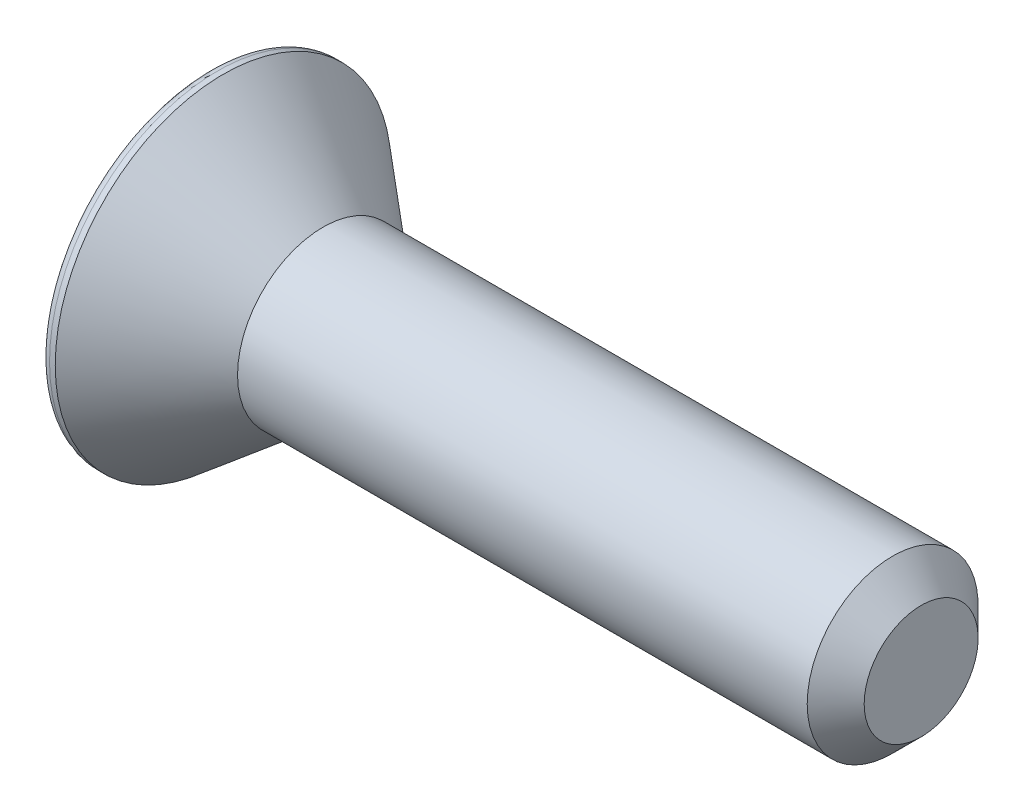
ISO-10303-21;
HEADER;
FILE_DESCRIPTION(('STEP AP214'),'2;1');
FILE_NAME('part.step','',(''),(''),'','','');
FILE_SCHEMA(('AUTOMOTIVE_DESIGN { 1 0 10303 214 1 1 1 1 }'));
ENDSEC;
DATA;
#1=APPLICATION_CONTEXT('core data for automotive mechanical design processes');
#2=APPLICATION_PROTOCOL_DEFINITION('international standard','automotive_design',2000,#1);
#3=PRODUCT_CONTEXT('',#1,'mechanical');
#4=PRODUCT('Part','Part','',(#3));
#5=PRODUCT_RELATED_PRODUCT_CATEGORY('part','',(#4));
#6=PRODUCT_DEFINITION_FORMATION('','',#4);
#7=PRODUCT_DEFINITION_CONTEXT('part definition',#1,'design');
#8=PRODUCT_DEFINITION('design','',#6,#7);
#9=PRODUCT_DEFINITION_SHAPE('','',#8);
#10=(LENGTH_UNIT() NAMED_UNIT(*) SI_UNIT(.MILLI.,.METRE.));
#11=(NAMED_UNIT(*) PLANE_ANGLE_UNIT() SI_UNIT($,.RADIAN.));
#12=(NAMED_UNIT(*) SI_UNIT($,.STERADIAN.) SOLID_ANGLE_UNIT());
#13=UNCERTAINTY_MEASURE_WITH_UNIT(LENGTH_MEASURE(1.E-05),#10,'distance_accuracy_value','');
#14=(GEOMETRIC_REPRESENTATION_CONTEXT(3) GLOBAL_UNCERTAINTY_ASSIGNED_CONTEXT((#13)) GLOBAL_UNIT_ASSIGNED_CONTEXT((#10,
#11,#12)) REPRESENTATION_CONTEXT('',''));
#15=CARTESIAN_POINT('',(0.,0.,0.));
#16=DIRECTION('',(0.,0.,1.));
#17=DIRECTION('',(1.,0.,0.));
#18=AXIS2_PLACEMENT_3D('',#15,#16,#17);
#19=CARTESIAN_POINT('',(0.,0.,0.));
#20=DIRECTION('',(1.,0.,0.));
#21=DIRECTION('',(0.,0.,-1.));
#22=AXIS2_PLACEMENT_3D('',#19,#20,#21);
#23=PLANE('',#22);
#24=CARTESIAN_POINT('',(0.,0.,0.));
#25=DIRECTION('',(1.,0.,0.));
#26=DIRECTION('',(0.,0.,-1.));
#27=AXIS2_PLACEMENT_3D('',#24,#25,#26);
#28=CIRCLE('',#27,5.6);
#29=CARTESIAN_POINT('',(0.,0.,-5.6));
#30=VERTEX_POINT('',#29);
#31=EDGE_CURVE('E153',#30,#30,#28,.F.);
#32=ORIENTED_EDGE('',*,*,#31,.T.);
#33=EDGE_LOOP('',(#32));
#34=FACE_BOUND('',#33,.T.);
#35=DIRECTION('',(0.,0.,-1.));
#36=VECTOR('',#35,1.);
#37=CARTESIAN_POINT('',(0.,2.,1.15470053837925));
#38=LINE('',#37,#36);
#39=CARTESIAN_POINT('',(0.,2.,1.15470053837925));
#40=VERTEX_POINT('',#39);
#41=CARTESIAN_POINT('',(0.,2.,-1.15470053837925));
#42=VERTEX_POINT('',#41);
#43=EDGE_CURVE('E129',#40,#42,#38,.T.);
#44=ORIENTED_EDGE('',*,*,#43,.F.);
#45=DIRECTION('',(0.,0.866025403784438,-0.5));
#46=VECTOR('',#45,1.);
#47=CARTESIAN_POINT('',(0.,0.,2.3094010767585));
#48=LINE('',#47,#46);
#49=CARTESIAN_POINT('',(0.,0.,2.3094010767585));
#50=VERTEX_POINT('',#49);
#51=EDGE_CURVE('E55',#50,#40,#48,.T.);
#52=ORIENTED_EDGE('',*,*,#51,.F.);
#53=DIRECTION('',(0.,0.866025403784438,0.5));
#54=VECTOR('',#53,1.);
#55=CARTESIAN_POINT('',(0.,-2.,1.15470053837925));
#56=LINE('',#55,#54);
#57=CARTESIAN_POINT('',(0.,-2.,1.15470053837925));
#58=VERTEX_POINT('',#57);
#59=EDGE_CURVE('E138',#58,#50,#56,.T.);
#60=ORIENTED_EDGE('',*,*,#59,.F.);
#61=DIRECTION('',(0.,0.,1.));
#62=VECTOR('',#61,1.);
#63=CARTESIAN_POINT('',(0.,-2.,-1.15470053837925));
#64=LINE('',#63,#62);
#65=CARTESIAN_POINT('',(0.,-2.,-1.15470053837925));
#66=VERTEX_POINT('',#65);
#67=EDGE_CURVE('E136',#66,#58,#64,.T.);
#68=ORIENTED_EDGE('',*,*,#67,.F.);
#69=DIRECTION('',(0.,-0.866025403784439,0.5));
#70=VECTOR('',#69,1.);
#71=CARTESIAN_POINT('',(0.,0.,-2.3094010767585));
#72=LINE('',#71,#70);
#73=CARTESIAN_POINT('',(0.,0.,-2.3094010767585));
#74=VERTEX_POINT('',#73);
#75=EDGE_CURVE('E103',#74,#66,#72,.T.);
#76=ORIENTED_EDGE('',*,*,#75,.F.);
#77=DIRECTION('',(0.,-0.866025403784439,-0.5));
#78=VECTOR('',#77,1.);
#79=CARTESIAN_POINT('',(0.,2.,-1.15470053837925));
#80=LINE('',#79,#78);
#81=EDGE_CURVE('E132',#42,#74,#80,.T.);
#82=ORIENTED_EDGE('',*,*,#81,.F.);
#83=EDGE_LOOP('',(#44,#52,#60,#68,#76,#82));
#84=FACE_BOUND('',#83,.T.);
#85=ADVANCED_FACE('F39',(#34,#84),#23,.F.);
#86=CARTESIAN_POINT('',(0.,0.,0.));
#87=DIRECTION('',(-1.,0.,0.));
#88=DIRECTION('',(0.,0.,1.));
#89=AXIS2_PLACEMENT_3D('',#86,#87,#88);
#90=CYLINDRICAL_SURFACE('',#89,5.9);
#91=CARTESIAN_POINT('',(0.3,0.,0.));
#92=DIRECTION('',(1.,0.,0.));
#93=DIRECTION('',(0.,0.,-1.));
#94=AXIS2_PLACEMENT_3D('',#91,#92,#93);
#95=CIRCLE('',#94,5.9);
#96=CARTESIAN_POINT('',(0.3,0.,-5.9));
#97=VERTEX_POINT('',#96);
#98=EDGE_CURVE('E156',#97,#97,#95,.T.);
#99=ORIENTED_EDGE('',*,*,#98,.T.);
#100=EDGE_LOOP('',(#99));
#101=FACE_BOUND('',#100,.T.);
#102=CARTESIAN_POINT('',(0.5,0.,0.));
#103=DIRECTION('',(-1.,0.,0.));
#104=DIRECTION('',(0.,0.,1.));
#105=AXIS2_PLACEMENT_3D('',#102,#103,#104);
#106=CIRCLE('',#105,5.9);
#107=CARTESIAN_POINT('',(0.5,0.,5.9));
#108=VERTEX_POINT('',#107);
#109=EDGE_CURVE('E150',#108,#108,#106,.T.);
#110=ORIENTED_EDGE('',*,*,#109,.T.);
#111=EDGE_LOOP('',(#110));
#112=FACE_BOUND('',#111,.T.);
#113=ADVANCED_FACE('F173',(#101,#112),#90,.T.);
#114=CARTESIAN_POINT('',(4.,0.,0.));
#115=DIRECTION('',(-1.,0.,0.));
#116=DIRECTION('',(0.,0.,1.));
#117=AXIS2_PLACEMENT_3D('',#114,#115,#116);
#118=CONICAL_SURFACE('',#117,3.,0.691921382238859);
#119=ORIENTED_EDGE('',*,*,#109,.F.);
#120=EDGE_LOOP('',(#119));
#121=FACE_BOUND('',#120,.T.);
#122=CARTESIAN_POINT('',(4.,0.,0.));
#123=DIRECTION('',(-1.,0.,0.));
#124=DIRECTION('',(0.,0.,1.));
#125=AXIS2_PLACEMENT_3D('',#122,#123,#124);
#126=CIRCLE('',#125,3.);
#127=CARTESIAN_POINT('',(4.,0.,3.));
#128=VERTEX_POINT('',#127);
#129=EDGE_CURVE('E142',#128,#128,#126,.T.);
#130=ORIENTED_EDGE('',*,*,#129,.T.);
#131=EDGE_LOOP('',(#130));
#132=FACE_BOUND('',#131,.T.);
#133=ADVANCED_FACE('F179',(#121,#132),#118,.T.);
#134=CARTESIAN_POINT('',(0.,0.,0.));
#135=DIRECTION('',(-1.,0.,0.));
#136=DIRECTION('',(0.,0.,1.));
#137=AXIS2_PLACEMENT_3D('',#134,#135,#136);
#138=CYLINDRICAL_SURFACE('',#137,3.);
#139=CARTESIAN_POINT('',(24.,0.,0.));
#140=DIRECTION('',(-1.,0.,0.));
#141=DIRECTION('',(0.,0.,1.));
#142=AXIS2_PLACEMENT_3D('',#139,#140,#141);
#143=CIRCLE('',#142,3.);
#144=CARTESIAN_POINT('',(24.,0.,3.));
#145=VERTEX_POINT('',#144);
#146=EDGE_CURVE('E48',#145,#145,#143,.T.);
#147=ORIENTED_EDGE('',*,*,#146,.T.);
#148=EDGE_LOOP('',(#147));
#149=FACE_BOUND('',#148,.T.);
#150=ORIENTED_EDGE('',*,*,#129,.F.);
#151=EDGE_LOOP('',(#150));
#152=FACE_BOUND('',#151,.T.);
#153=ADVANCED_FACE('F161',(#149,#152),#138,.T.);
#154=CARTESIAN_POINT('',(25.,3.,0.));
#155=DIRECTION('',(-1.,0.,0.));
#156=DIRECTION('',(0.,0.,1.));
#157=AXIS2_PLACEMENT_3D('',#154,#155,#156);
#158=PLANE('',#157);
#159=CARTESIAN_POINT('',(25.,0.,0.));
#160=DIRECTION('',(-1.,0.,0.));
#161=DIRECTION('',(0.,0.,1.));
#162=AXIS2_PLACEMENT_3D('',#159,#160,#161);
#163=CIRCLE('',#162,1.99999999999998);
#164=CARTESIAN_POINT('',(25.,0.,1.99999999999998));
#165=VERTEX_POINT('',#164);
#166=EDGE_CURVE('E11',#165,#165,#163,.F.);
#167=ORIENTED_EDGE('',*,*,#166,.T.);
#168=EDGE_LOOP('',(#167));
#169=FACE_BOUND('',#168,.T.);
#170=ADVANCED_FACE('F189',(#169),#158,.F.);
#171=CARTESIAN_POINT('',(3.,0.,2.3094010767585));
#172=DIRECTION('',(0.,0.5,0.866025403784439));
#173=DIRECTION('',(0.,-0.866025403784439,0.5));
#174=AXIS2_PLACEMENT_3D('',#171,#172,#173);
#175=PLANE('',#174);
#176=ORIENTED_EDGE('',*,*,#51,.T.);
#177=DIRECTION('',(-1.,0.,0.));
#178=VECTOR('',#177,1.);
#179=CARTESIAN_POINT('',(3.,2.,1.15470053837925));
#180=LINE('',#179,#178);
#181=CARTESIAN_POINT('',(3.,2.,1.15470053837925));
#182=VERTEX_POINT('',#181);
#183=EDGE_CURVE('E85',#182,#40,#180,.T.);
#184=ORIENTED_EDGE('',*,*,#183,.F.);
#185=DIRECTION('',(0.,0.866025403784438,-0.5));
#186=VECTOR('',#185,1.);
#187=CARTESIAN_POINT('',(3.,0.,2.3094010767585));
#188=LINE('',#187,#186);
#189=CARTESIAN_POINT('',(3.,0.,2.3094010767585));
#190=VERTEX_POINT('',#189);
#191=EDGE_CURVE('E140',#190,#182,#188,.T.);
#192=ORIENTED_EDGE('',*,*,#191,.F.);
#193=DIRECTION('',(-1.,0.,0.));
#194=VECTOR('',#193,1.);
#195=CARTESIAN_POINT('',(3.,0.,2.3094010767585));
#196=LINE('',#195,#194);
#197=EDGE_CURVE('E63',#190,#50,#196,.T.);
#198=ORIENTED_EDGE('',*,*,#197,.T.);
#199=EDGE_LOOP('',(#176,#184,#192,#198));
#200=FACE_BOUND('',#199,.T.);
#201=ADVANCED_FACE('F192',(#200),#175,.F.);
#202=CARTESIAN_POINT('',(3.,-2.,1.15470053837925));
#203=DIRECTION('',(0.,-0.5,0.866025403784439));
#204=DIRECTION('',(0.,-0.866025403784439,-0.5));
#205=AXIS2_PLACEMENT_3D('',#202,#203,#204);
#206=PLANE('',#205);
#207=ORIENTED_EDGE('',*,*,#59,.T.);
#208=ORIENTED_EDGE('',*,*,#197,.F.);
#209=DIRECTION('',(0.,0.866025403784438,0.5));
#210=VECTOR('',#209,1.);
#211=CARTESIAN_POINT('',(3.,-2.,1.15470053837925));
#212=LINE('',#211,#210);
#213=CARTESIAN_POINT('',(3.,-2.,1.15470053837925));
#214=VERTEX_POINT('',#213);
#215=EDGE_CURVE('E115',#214,#190,#212,.T.);
#216=ORIENTED_EDGE('',*,*,#215,.F.);
#217=DIRECTION('',(-1.,0.,0.));
#218=VECTOR('',#217,1.);
#219=CARTESIAN_POINT('',(3.,-2.,1.15470053837925));
#220=LINE('',#219,#218);
#221=EDGE_CURVE('E107',#214,#58,#220,.T.);
#222=ORIENTED_EDGE('',*,*,#221,.T.);
#223=EDGE_LOOP('',(#207,#208,#216,#222));
#224=FACE_BOUND('',#223,.T.);
#225=ADVANCED_FACE('F196',(#224),#206,.F.);
#226=CARTESIAN_POINT('',(3.,-2.,-1.15470053837925));
#227=DIRECTION('',(0.,-1.,0.));
#228=DIRECTION('',(0.,0.,-1.));
#229=AXIS2_PLACEMENT_3D('',#226,#227,#228);
#230=PLANE('',#229);
#231=ORIENTED_EDGE('',*,*,#67,.T.);
#232=ORIENTED_EDGE('',*,*,#221,.F.);
#233=DIRECTION('',(0.,0.,1.));
#234=VECTOR('',#233,1.);
#235=CARTESIAN_POINT('',(3.,-2.,-1.15470053837925));
#236=LINE('',#235,#234);
#237=CARTESIAN_POINT('',(3.,-2.,-1.15470053837925));
#238=VERTEX_POINT('',#237);
#239=EDGE_CURVE('E111',#238,#214,#236,.T.);
#240=ORIENTED_EDGE('',*,*,#239,.F.);
#241=DIRECTION('',(-1.,0.,0.));
#242=VECTOR('',#241,1.);
#243=CARTESIAN_POINT('',(3.,-2.,-1.15470053837925));
#244=LINE('',#243,#242);
#245=EDGE_CURVE('E96',#238,#66,#244,.T.);
#246=ORIENTED_EDGE('',*,*,#245,.T.);
#247=EDGE_LOOP('',(#231,#232,#240,#246));
#248=FACE_BOUND('',#247,.T.);
#249=ADVANCED_FACE('F112',(#248),#230,.F.);
#250=CARTESIAN_POINT('',(3.,0.,-2.3094010767585));
#251=DIRECTION('',(0.,-0.5,-0.866025403784439));
#252=DIRECTION('',(0.,0.866025403784439,-0.5));
#253=AXIS2_PLACEMENT_3D('',#250,#251,#252);
#254=PLANE('',#253);
#255=ORIENTED_EDGE('',*,*,#75,.T.);
#256=ORIENTED_EDGE('',*,*,#245,.F.);
#257=DIRECTION('',(0.,-0.866025403784439,0.5));
#258=VECTOR('',#257,1.);
#259=CARTESIAN_POINT('',(3.,0.,-2.3094010767585));
#260=LINE('',#259,#258);
#261=CARTESIAN_POINT('',(3.,0.,-2.3094010767585));
#262=VERTEX_POINT('',#261);
#263=EDGE_CURVE('E100',#262,#238,#260,.T.);
#264=ORIENTED_EDGE('',*,*,#263,.F.);
#265=DIRECTION('',(-1.,0.,0.));
#266=VECTOR('',#265,1.);
#267=CARTESIAN_POINT('',(3.,0.,-2.3094010767585));
#268=LINE('',#267,#266);
#269=EDGE_CURVE('E108',#262,#74,#268,.T.);
#270=ORIENTED_EDGE('',*,*,#269,.T.);
#271=EDGE_LOOP('',(#255,#256,#264,#270));
#272=FACE_BOUND('',#271,.T.);
#273=ADVANCED_FACE('F98',(#272),#254,.F.);
#274=CARTESIAN_POINT('',(3.,2.,-1.15470053837925));
#275=DIRECTION('',(0.,0.5,-0.866025403784439));
#276=DIRECTION('',(0.,0.866025403784439,0.5));
#277=AXIS2_PLACEMENT_3D('',#274,#275,#276);
#278=PLANE('',#277);
#279=ORIENTED_EDGE('',*,*,#81,.T.);
#280=ORIENTED_EDGE('',*,*,#269,.F.);
#281=DIRECTION('',(0.,-0.866025403784439,-0.5));
#282=VECTOR('',#281,1.);
#283=CARTESIAN_POINT('',(3.,2.,-1.15470053837925));
#284=LINE('',#283,#282);
#285=CARTESIAN_POINT('',(3.,2.,-1.15470053837925));
#286=VERTEX_POINT('',#285);
#287=EDGE_CURVE('E121',#286,#262,#284,.T.);
#288=ORIENTED_EDGE('',*,*,#287,.F.);
#289=DIRECTION('',(-1.,0.,0.));
#290=VECTOR('',#289,1.);
#291=CARTESIAN_POINT('',(3.,2.,-1.15470053837925));
#292=LINE('',#291,#290);
#293=EDGE_CURVE('E145',#286,#42,#292,.T.);
#294=ORIENTED_EDGE('',*,*,#293,.T.);
#295=EDGE_LOOP('',(#279,#280,#288,#294));
#296=FACE_BOUND('',#295,.T.);
#297=ADVANCED_FACE('F200',(#296),#278,.F.);
#298=CARTESIAN_POINT('',(3.,2.,1.15470053837925));
#299=DIRECTION('',(0.,1.,0.));
#300=DIRECTION('',(0.,0.,1.));
#301=AXIS2_PLACEMENT_3D('',#298,#299,#300);
#302=PLANE('',#301);
#303=ORIENTED_EDGE('',*,*,#43,.T.);
#304=ORIENTED_EDGE('',*,*,#293,.F.);
#305=DIRECTION('',(0.,0.,-1.));
#306=VECTOR('',#305,1.);
#307=CARTESIAN_POINT('',(3.,2.,1.15470053837925));
#308=LINE('',#307,#306);
#309=EDGE_CURVE('E123',#182,#286,#308,.T.);
#310=ORIENTED_EDGE('',*,*,#309,.F.);
#311=ORIENTED_EDGE('',*,*,#183,.T.);
#312=EDGE_LOOP('',(#303,#304,#310,#311));
#313=FACE_BOUND('',#312,.T.);
#314=ADVANCED_FACE('F197',(#313),#302,.F.);
#315=CARTESIAN_POINT('',(3.,0.,0.));
#316=DIRECTION('',(-1.,0.,0.));
#317=DIRECTION('',(0.,0.,1.));
#318=AXIS2_PLACEMENT_3D('',#315,#316,#317);
#319=PLANE('',#318);
#320=ORIENTED_EDGE('',*,*,#191,.T.);
#321=ORIENTED_EDGE('',*,*,#309,.T.);
#322=ORIENTED_EDGE('',*,*,#287,.T.);
#323=ORIENTED_EDGE('',*,*,#263,.T.);
#324=ORIENTED_EDGE('',*,*,#239,.T.);
#325=ORIENTED_EDGE('',*,*,#215,.T.);
#326=EDGE_LOOP('',(#320,#321,#322,#323,#324,#325));
#327=FACE_BOUND('',#326,.T.);
#328=ADVANCED_FACE('F118',(#327),#319,.T.);
#329=CARTESIAN_POINT('',(0.3,0.,0.));
#330=DIRECTION('',(1.,0.,0.));
#331=DIRECTION('',(0.,0.,-1.));
#332=AXIS2_PLACEMENT_3D('',#329,#330,#331);
#333=TOROIDAL_SURFACE('',#332,5.6,0.3);
#334=ORIENTED_EDGE('',*,*,#98,.F.);
#335=EDGE_LOOP('',(#334));
#336=FACE_BOUND('',#335,.T.);
#337=ORIENTED_EDGE('',*,*,#31,.F.);
#338=EDGE_LOOP('',(#337));
#339=FACE_BOUND('',#338,.T.);
#340=ADVANCED_FACE('F165',(#336,#339),#333,.T.);
#341=CARTESIAN_POINT('',(24.,0.,0.));
#342=DIRECTION('',(-1.,0.,0.));
#343=DIRECTION('',(0.,0.,1.));
#344=AXIS2_PLACEMENT_3D('',#341,#342,#343);
#345=CONICAL_SURFACE('',#344,3.,0.785398163397453);
#346=ORIENTED_EDGE('',*,*,#166,.F.);
#347=EDGE_LOOP('',(#346));
#348=FACE_BOUND('',#347,.T.);
#349=ORIENTED_EDGE('',*,*,#146,.F.);
#350=EDGE_LOOP('',(#349));
#351=FACE_BOUND('',#350,.T.);
#352=ADVANCED_FACE('F42',(#348,#351),#345,.T.);
#353=CLOSED_SHELL('',(#85,#113,#133,#153,#170,#201,#225,#249,#273,#297,#314,#328,#340,#352));
#354=MANIFOLD_SOLID_BREP('B2',#353);
#355=ADVANCED_BREP_SHAPE_REPRESENTATION('',(#18,#354),#14);
#356=SHAPE_DEFINITION_REPRESENTATION(#9,#355);
ENDSEC;
END-ISO-10303-21;
